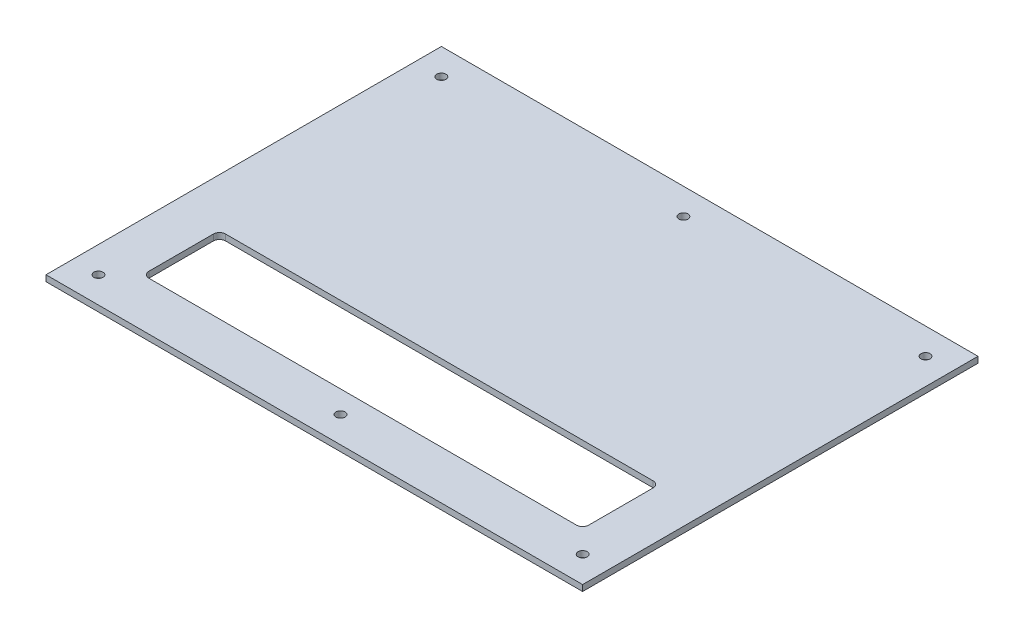
ISO-10303-21;
HEADER;
FILE_DESCRIPTION(('STEP AP214'),'2;1');
FILE_NAME('part.step','',(''),(''),'','','');
FILE_SCHEMA(('AUTOMOTIVE_DESIGN { 1 0 10303 214 1 1 1 1 }'));
ENDSEC;
DATA;
#1=APPLICATION_CONTEXT('core data for automotive mechanical design processes');
#2=APPLICATION_PROTOCOL_DEFINITION('international standard','automotive_design',2000,#1);
#3=PRODUCT_CONTEXT('',#1,'mechanical');
#4=PRODUCT('Part','Part','',(#3));
#5=PRODUCT_RELATED_PRODUCT_CATEGORY('part','',(#4));
#6=PRODUCT_DEFINITION_FORMATION('','',#4);
#7=PRODUCT_DEFINITION_CONTEXT('part definition',#1,'design');
#8=PRODUCT_DEFINITION('design','',#6,#7);
#9=PRODUCT_DEFINITION_SHAPE('','',#8);
#10=(LENGTH_UNIT() NAMED_UNIT(*) SI_UNIT(.MILLI.,.METRE.));
#11=(NAMED_UNIT(*) PLANE_ANGLE_UNIT() SI_UNIT($,.RADIAN.));
#12=(NAMED_UNIT(*) SI_UNIT($,.STERADIAN.) SOLID_ANGLE_UNIT());
#13=UNCERTAINTY_MEASURE_WITH_UNIT(LENGTH_MEASURE(1.E-05),#10,'distance_accuracy_value','');
#14=(GEOMETRIC_REPRESENTATION_CONTEXT(3) GLOBAL_UNCERTAINTY_ASSIGNED_CONTEXT((#13)) GLOBAL_UNIT_ASSIGNED_CONTEXT((#10,
#11,#12)) REPRESENTATION_CONTEXT('',''));
#15=CARTESIAN_POINT('',(0.,0.,0.));
#16=DIRECTION('',(0.,0.,1.));
#17=DIRECTION('',(1.,0.,0.));
#18=AXIS2_PLACEMENT_3D('',#15,#16,#17);
#19=CARTESIAN_POINT('',(0.,3.,0.));
#20=DIRECTION('',(0.,-1.,0.));
#21=DIRECTION('',(0.,0.,-1.));
#22=AXIS2_PLACEMENT_3D('',#19,#20,#21);
#23=PLANE('',#22);
#24=DIRECTION('',(0.,0.,1.));
#25=VECTOR('',#24,1.);
#26=CARTESIAN_POINT('',(241.999999999998,3.,-24.));
#27=LINE('',#26,#25);
#28=CARTESIAN_POINT('',(241.999999999998,3.,-59.));
#29=VERTEX_POINT('',#28);
#30=CARTESIAN_POINT('',(241.999999999998,3.,-27.));
#31=VERTEX_POINT('',#30);
#32=EDGE_CURVE('E208',#29,#31,#27,.T.);
#33=ORIENTED_EDGE('',*,*,#32,.T.);
#34=CARTESIAN_POINT('',(238.999999999998,3.,-27.));
#35=DIRECTION('',(0.,-1.,0.));
#36=DIRECTION('',(0.,0.,-1.));
#37=AXIS2_PLACEMENT_3D('',#34,#35,#36);
#38=CIRCLE('',#37,3.);
#39=CARTESIAN_POINT('',(238.999999999998,3.,-24.));
#40=VERTEX_POINT('',#39);
#41=EDGE_CURVE('E180',#31,#40,#38,.T.);
#42=ORIENTED_EDGE('',*,*,#41,.T.);
#43=DIRECTION('',(-1.,0.,0.));
#44=VECTOR('',#43,1.);
#45=CARTESIAN_POINT('',(23.9999999999977,3.,-24.));
#46=LINE('',#45,#44);
#47=CARTESIAN_POINT('',(26.9999999999977,3.,-24.));
#48=VERTEX_POINT('',#47);
#49=EDGE_CURVE('E213',#40,#48,#46,.T.);
#50=ORIENTED_EDGE('',*,*,#49,.T.);
#51=CARTESIAN_POINT('',(26.9999999999977,3.,-27.));
#52=DIRECTION('',(0.,-1.,0.));
#53=DIRECTION('',(0.,0.,-1.));
#54=AXIS2_PLACEMENT_3D('',#51,#52,#53);
#55=CIRCLE('',#54,3.);
#56=CARTESIAN_POINT('',(23.9999999999977,3.,-27.));
#57=VERTEX_POINT('',#56);
#58=EDGE_CURVE('E11',#48,#57,#55,.T.);
#59=ORIENTED_EDGE('',*,*,#58,.T.);
#60=DIRECTION('',(0.,0.,-1.));
#61=VECTOR('',#60,1.);
#62=CARTESIAN_POINT('',(23.9999999999977,3.,-24.));
#63=LINE('',#62,#61);
#64=CARTESIAN_POINT('',(23.9999999999977,3.,-59.));
#65=VERTEX_POINT('',#64);
#66=EDGE_CURVE('E200',#57,#65,#63,.T.);
#67=ORIENTED_EDGE('',*,*,#66,.T.);
#68=CARTESIAN_POINT('',(26.9999999999977,3.,-59.));
#69=DIRECTION('',(0.,-1.,0.));
#70=DIRECTION('',(0.,0.,-1.));
#71=AXIS2_PLACEMENT_3D('',#68,#69,#70);
#72=CIRCLE('',#71,3.);
#73=CARTESIAN_POINT('',(26.9999999999977,3.,-62.));
#74=VERTEX_POINT('',#73);
#75=EDGE_CURVE('E184',#65,#74,#72,.T.);
#76=ORIENTED_EDGE('',*,*,#75,.T.);
#77=DIRECTION('',(1.,0.,0.));
#78=VECTOR('',#77,1.);
#79=CARTESIAN_POINT('',(23.9999999999977,3.,-62.));
#80=LINE('',#79,#78);
#81=CARTESIAN_POINT('',(238.999999999998,3.,-62.));
#82=VERTEX_POINT('',#81);
#83=EDGE_CURVE('E205',#74,#82,#80,.T.);
#84=ORIENTED_EDGE('',*,*,#83,.T.);
#85=CARTESIAN_POINT('',(238.999999999998,3.,-59.));
#86=DIRECTION('',(0.,-1.,0.));
#87=DIRECTION('',(0.,0.,-1.));
#88=AXIS2_PLACEMENT_3D('',#85,#86,#87);
#89=CIRCLE('',#88,3.);
#90=EDGE_CURVE('E176',#82,#29,#89,.T.);
#91=ORIENTED_EDGE('',*,*,#90,.T.);
#92=EDGE_LOOP('',(#33,#42,#50,#59,#67,#76,#84,#91));
#93=FACE_BOUND('',#92,.T.);
#94=DIRECTION('',(0.,0.,1.));
#95=VECTOR('',#94,1.);
#96=CARTESIAN_POINT('',(0.,3.,0.));
#97=LINE('',#96,#95);
#98=CARTESIAN_POINT('',(0.,3.,-196.));
#99=VERTEX_POINT('',#98);
#100=CARTESIAN_POINT('',(0.,3.,0.));
#101=VERTEX_POINT('',#100);
#102=EDGE_CURVE('E136',#99,#101,#97,.T.);
#103=ORIENTED_EDGE('',*,*,#102,.T.);
#104=DIRECTION('',(1.,0.,0.));
#105=VECTOR('',#104,1.);
#106=CARTESIAN_POINT('',(0.,3.,0.));
#107=LINE('',#106,#105);
#108=CARTESIAN_POINT('',(266.,3.,0.));
#109=VERTEX_POINT('',#108);
#110=EDGE_CURVE('E125',#101,#109,#107,.T.);
#111=ORIENTED_EDGE('',*,*,#110,.T.);
#112=DIRECTION('',(0.,0.,-1.));
#113=VECTOR('',#112,1.);
#114=CARTESIAN_POINT('',(266.,3.,0.));
#115=LINE('',#114,#113);
#116=CARTESIAN_POINT('',(266.,3.,-196.));
#117=VERTEX_POINT('',#116);
#118=EDGE_CURVE('E135',#109,#117,#115,.T.);
#119=ORIENTED_EDGE('',*,*,#118,.T.);
#120=DIRECTION('',(-1.,0.,0.));
#121=VECTOR('',#120,1.);
#122=CARTESIAN_POINT('',(0.,3.,-196.));
#123=LINE('',#122,#121);
#124=EDGE_CURVE('E141',#117,#99,#123,.T.);
#125=ORIENTED_EDGE('',*,*,#124,.T.);
#126=EDGE_LOOP('',(#103,#111,#119,#125));
#127=FACE_BOUND('',#126,.T.);
#128=CARTESIAN_POINT('',(13.,3.,-183.));
#129=DIRECTION('',(0.,1.,0.));
#130=DIRECTION('',(0.,0.,1.));
#131=AXIS2_PLACEMENT_3D('',#128,#129,#130);
#132=CIRCLE('',#131,2.25);
#133=CARTESIAN_POINT('',(13.,3.,-180.75));
#134=VERTEX_POINT('',#133);
#135=EDGE_CURVE('E252',#134,#134,#132,.T.);
#136=ORIENTED_EDGE('',*,*,#135,.F.);
#137=EDGE_LOOP('',(#136));
#138=FACE_BOUND('',#137,.T.);
#139=CARTESIAN_POINT('',(253.,3.,-183.));
#140=DIRECTION('',(0.,1.,0.));
#141=DIRECTION('',(0.,0.,1.));
#142=AXIS2_PLACEMENT_3D('',#139,#140,#141);
#143=CIRCLE('',#142,2.24999999999996);
#144=CARTESIAN_POINT('',(253.,3.,-180.75));
#145=VERTEX_POINT('',#144);
#146=EDGE_CURVE('E246',#145,#145,#143,.T.);
#147=ORIENTED_EDGE('',*,*,#146,.F.);
#148=EDGE_LOOP('',(#147));
#149=FACE_BOUND('',#148,.T.);
#150=CARTESIAN_POINT('',(253.,3.,-13.));
#151=DIRECTION('',(0.,1.,0.));
#152=DIRECTION('',(0.,0.,1.));
#153=AXIS2_PLACEMENT_3D('',#150,#151,#152);
#154=CIRCLE('',#153,2.24999999999995);
#155=CARTESIAN_POINT('',(253.,3.,-10.7500000000001));
#156=VERTEX_POINT('',#155);
#157=EDGE_CURVE('E240',#156,#156,#154,.T.);
#158=ORIENTED_EDGE('',*,*,#157,.F.);
#159=EDGE_LOOP('',(#158));
#160=FACE_BOUND('',#159,.T.);
#161=CARTESIAN_POINT('',(13.,3.,-13.));
#162=DIRECTION('',(0.,1.,0.));
#163=DIRECTION('',(0.,0.,1.));
#164=AXIS2_PLACEMENT_3D('',#161,#162,#163);
#165=CIRCLE('',#164,2.25);
#166=CARTESIAN_POINT('',(13.,3.,-10.75));
#167=VERTEX_POINT('',#166);
#168=EDGE_CURVE('E234',#167,#167,#165,.T.);
#169=ORIENTED_EDGE('',*,*,#168,.F.);
#170=EDGE_LOOP('',(#169));
#171=FACE_BOUND('',#170,.T.);
#172=CARTESIAN_POINT('',(133.,3.,-13.));
#173=DIRECTION('',(0.,1.,0.));
#174=DIRECTION('',(0.,0.,1.));
#175=AXIS2_PLACEMENT_3D('',#172,#173,#174);
#176=CIRCLE('',#175,2.25000000000004);
#177=CARTESIAN_POINT('',(133.,3.,-10.75));
#178=VERTEX_POINT('',#177);
#179=EDGE_CURVE('E228',#178,#178,#176,.T.);
#180=ORIENTED_EDGE('',*,*,#179,.F.);
#181=EDGE_LOOP('',(#180));
#182=FACE_BOUND('',#181,.T.);
#183=CARTESIAN_POINT('',(133.,3.,-183.));
#184=DIRECTION('',(0.,1.,0.));
#185=DIRECTION('',(0.,0.,1.));
#186=AXIS2_PLACEMENT_3D('',#183,#184,#185);
#187=CIRCLE('',#186,2.25000000000001);
#188=CARTESIAN_POINT('',(133.,3.,-180.75));
#189=VERTEX_POINT('',#188);
#190=EDGE_CURVE('E222',#189,#189,#187,.T.);
#191=ORIENTED_EDGE('',*,*,#190,.F.);
#192=EDGE_LOOP('',(#191));
#193=FACE_BOUND('',#192,.T.);
#194=ADVANCED_FACE('F36',(#93,#127,#138,#149,#160,#171,#182,#193),#23,.F.);
#195=CARTESIAN_POINT('',(0.,0.,0.));
#196=DIRECTION('',(0.,-1.,0.));
#197=DIRECTION('',(0.,0.,-1.));
#198=AXIS2_PLACEMENT_3D('',#195,#196,#197);
#199=PLANE('',#198);
#200=DIRECTION('',(0.,0.,-1.));
#201=VECTOR('',#200,1.);
#202=CARTESIAN_POINT('',(23.9999999999977,0.,-24.));
#203=LINE('',#202,#201);
#204=CARTESIAN_POINT('',(23.9999999999977,0.,-27.));
#205=VERTEX_POINT('',#204);
#206=CARTESIAN_POINT('',(23.9999999999977,0.,-59.));
#207=VERTEX_POINT('',#206);
#208=EDGE_CURVE('E192',#205,#207,#203,.T.);
#209=ORIENTED_EDGE('',*,*,#208,.F.);
#210=CARTESIAN_POINT('',(26.9999999999977,0.,-27.));
#211=DIRECTION('',(0.,-1.,0.));
#212=DIRECTION('',(0.,0.,-1.));
#213=AXIS2_PLACEMENT_3D('',#210,#211,#212);
#214=CIRCLE('',#213,3.);
#215=CARTESIAN_POINT('',(26.9999999999977,0.,-24.));
#216=VERTEX_POINT('',#215);
#217=EDGE_CURVE('E44',#205,#216,#214,.F.);
#218=ORIENTED_EDGE('',*,*,#217,.T.);
#219=DIRECTION('',(-1.,0.,0.));
#220=VECTOR('',#219,1.);
#221=CARTESIAN_POINT('',(23.9999999999977,0.,-24.));
#222=LINE('',#221,#220);
#223=CARTESIAN_POINT('',(238.999999999998,0.,-24.));
#224=VERTEX_POINT('',#223);
#225=EDGE_CURVE('E191',#224,#216,#222,.T.);
#226=ORIENTED_EDGE('',*,*,#225,.F.);
#227=CARTESIAN_POINT('',(238.999999999998,0.,-27.));
#228=DIRECTION('',(0.,-1.,0.));
#229=DIRECTION('',(0.,0.,-1.));
#230=AXIS2_PLACEMENT_3D('',#227,#228,#229);
#231=CIRCLE('',#230,3.);
#232=CARTESIAN_POINT('',(241.999999999998,0.,-27.));
#233=VERTEX_POINT('',#232);
#234=EDGE_CURVE('E178',#224,#233,#231,.F.);
#235=ORIENTED_EDGE('',*,*,#234,.T.);
#236=DIRECTION('',(0.,0.,1.));
#237=VECTOR('',#236,1.);
#238=CARTESIAN_POINT('',(241.999999999998,0.,-24.));
#239=LINE('',#238,#237);
#240=CARTESIAN_POINT('',(241.999999999998,0.,-59.));
#241=VERTEX_POINT('',#240);
#242=EDGE_CURVE('E201',#241,#233,#239,.T.);
#243=ORIENTED_EDGE('',*,*,#242,.F.);
#244=CARTESIAN_POINT('',(238.999999999998,0.,-59.));
#245=DIRECTION('',(0.,-1.,0.));
#246=DIRECTION('',(0.,0.,-1.));
#247=AXIS2_PLACEMENT_3D('',#244,#245,#246);
#248=CIRCLE('',#247,3.);
#249=CARTESIAN_POINT('',(238.999999999998,0.,-62.));
#250=VERTEX_POINT('',#249);
#251=EDGE_CURVE('E174',#241,#250,#248,.F.);
#252=ORIENTED_EDGE('',*,*,#251,.T.);
#253=DIRECTION('',(1.,0.,0.));
#254=VECTOR('',#253,1.);
#255=CARTESIAN_POINT('',(23.9999999999977,0.,-62.));
#256=LINE('',#255,#254);
#257=CARTESIAN_POINT('',(26.9999999999977,0.,-62.));
#258=VERTEX_POINT('',#257);
#259=EDGE_CURVE('E217',#258,#250,#256,.T.);
#260=ORIENTED_EDGE('',*,*,#259,.F.);
#261=CARTESIAN_POINT('',(26.9999999999977,0.,-59.));
#262=DIRECTION('',(0.,-1.,0.));
#263=DIRECTION('',(0.,0.,-1.));
#264=AXIS2_PLACEMENT_3D('',#261,#262,#263);
#265=CIRCLE('',#264,3.);
#266=EDGE_CURVE('E182',#258,#207,#265,.F.);
#267=ORIENTED_EDGE('',*,*,#266,.T.);
#268=EDGE_LOOP('',(#209,#218,#226,#235,#243,#252,#260,#267));
#269=FACE_BOUND('',#268,.T.);
#270=CARTESIAN_POINT('',(133.,0.,-13.));
#271=DIRECTION('',(0.,1.,0.));
#272=DIRECTION('',(0.,0.,1.));
#273=AXIS2_PLACEMENT_3D('',#270,#271,#272);
#274=CIRCLE('',#273,2.25000000000004);
#275=CARTESIAN_POINT('',(133.,0.,-10.75));
#276=VERTEX_POINT('',#275);
#277=EDGE_CURVE('E225',#276,#276,#274,.T.);
#278=ORIENTED_EDGE('',*,*,#277,.T.);
#279=EDGE_LOOP('',(#278));
#280=FACE_BOUND('',#279,.T.);
#281=CARTESIAN_POINT('',(253.,0.,-13.));
#282=DIRECTION('',(0.,1.,0.));
#283=DIRECTION('',(0.,0.,1.));
#284=AXIS2_PLACEMENT_3D('',#281,#282,#283);
#285=CIRCLE('',#284,2.24999999999995);
#286=CARTESIAN_POINT('',(253.,0.,-10.7500000000001));
#287=VERTEX_POINT('',#286);
#288=EDGE_CURVE('E237',#287,#287,#285,.T.);
#289=ORIENTED_EDGE('',*,*,#288,.T.);
#290=EDGE_LOOP('',(#289));
#291=FACE_BOUND('',#290,.T.);
#292=CARTESIAN_POINT('',(13.,0.,-183.));
#293=DIRECTION('',(0.,1.,0.));
#294=DIRECTION('',(0.,0.,1.));
#295=AXIS2_PLACEMENT_3D('',#292,#293,#294);
#296=CIRCLE('',#295,2.25);
#297=CARTESIAN_POINT('',(13.,0.,-180.75));
#298=VERTEX_POINT('',#297);
#299=EDGE_CURVE('E249',#298,#298,#296,.T.);
#300=ORIENTED_EDGE('',*,*,#299,.T.);
#301=EDGE_LOOP('',(#300));
#302=FACE_BOUND('',#301,.T.);
#303=DIRECTION('',(0.,0.,1.));
#304=VECTOR('',#303,1.);
#305=CARTESIAN_POINT('',(0.,0.,0.));
#306=LINE('',#305,#304);
#307=CARTESIAN_POINT('',(0.,0.,-196.));
#308=VERTEX_POINT('',#307);
#309=CARTESIAN_POINT('',(0.,0.,0.));
#310=VERTEX_POINT('',#309);
#311=EDGE_CURVE('E149',#308,#310,#306,.T.);
#312=ORIENTED_EDGE('',*,*,#311,.F.);
#313=DIRECTION('',(-1.,0.,0.));
#314=VECTOR('',#313,1.);
#315=CARTESIAN_POINT('',(0.,0.,-196.));
#316=LINE('',#315,#314);
#317=CARTESIAN_POINT('',(266.,0.,-196.));
#318=VERTEX_POINT('',#317);
#319=EDGE_CURVE('E145',#318,#308,#316,.T.);
#320=ORIENTED_EDGE('',*,*,#319,.F.);
#321=DIRECTION('',(0.,0.,-1.));
#322=VECTOR('',#321,1.);
#323=CARTESIAN_POINT('',(266.,0.,0.));
#324=LINE('',#323,#322);
#325=CARTESIAN_POINT('',(266.,0.,0.));
#326=VERTEX_POINT('',#325);
#327=EDGE_CURVE('E263',#326,#318,#324,.T.);
#328=ORIENTED_EDGE('',*,*,#327,.F.);
#329=DIRECTION('',(1.,0.,0.));
#330=VECTOR('',#329,1.);
#331=CARTESIAN_POINT('',(0.,0.,0.));
#332=LINE('',#331,#330);
#333=EDGE_CURVE('E261',#310,#326,#332,.T.);
#334=ORIENTED_EDGE('',*,*,#333,.F.);
#335=EDGE_LOOP('',(#312,#320,#328,#334));
#336=FACE_BOUND('',#335,.T.);
#337=CARTESIAN_POINT('',(253.,0.,-183.));
#338=DIRECTION('',(0.,1.,0.));
#339=DIRECTION('',(0.,0.,1.));
#340=AXIS2_PLACEMENT_3D('',#337,#338,#339);
#341=CIRCLE('',#340,2.24999999999996);
#342=CARTESIAN_POINT('',(253.,0.,-180.75));
#343=VERTEX_POINT('',#342);
#344=EDGE_CURVE('E243',#343,#343,#341,.T.);
#345=ORIENTED_EDGE('',*,*,#344,.T.);
#346=EDGE_LOOP('',(#345));
#347=FACE_BOUND('',#346,.T.);
#348=CARTESIAN_POINT('',(13.,0.,-13.));
#349=DIRECTION('',(0.,1.,0.));
#350=DIRECTION('',(0.,0.,1.));
#351=AXIS2_PLACEMENT_3D('',#348,#349,#350);
#352=CIRCLE('',#351,2.25);
#353=CARTESIAN_POINT('',(13.,0.,-10.75));
#354=VERTEX_POINT('',#353);
#355=EDGE_CURVE('E231',#354,#354,#352,.T.);
#356=ORIENTED_EDGE('',*,*,#355,.T.);
#357=EDGE_LOOP('',(#356));
#358=FACE_BOUND('',#357,.T.);
#359=CARTESIAN_POINT('',(133.,0.,-183.));
#360=DIRECTION('',(0.,1.,0.));
#361=DIRECTION('',(0.,0.,1.));
#362=AXIS2_PLACEMENT_3D('',#359,#360,#361);
#363=CIRCLE('',#362,2.25000000000001);
#364=CARTESIAN_POINT('',(133.,0.,-180.75));
#365=VERTEX_POINT('',#364);
#366=EDGE_CURVE('E215',#365,#365,#363,.T.);
#367=ORIENTED_EDGE('',*,*,#366,.T.);
#368=EDGE_LOOP('',(#367));
#369=FACE_BOUND('',#368,.T.);
#370=ADVANCED_FACE('F189',(#269,#280,#291,#302,#336,#347,#358,#369),#199,.T.);
#371=CARTESIAN_POINT('',(0.,3.,0.));
#372=DIRECTION('',(1.,0.,0.));
#373=DIRECTION('',(0.,0.,-1.));
#374=AXIS2_PLACEMENT_3D('',#371,#372,#373);
#375=PLANE('',#374);
#376=ORIENTED_EDGE('',*,*,#311,.T.);
#377=DIRECTION('',(0.,-1.,0.));
#378=VECTOR('',#377,1.);
#379=CARTESIAN_POINT('',(0.,3.,0.));
#380=LINE('',#379,#378);
#381=EDGE_CURVE('E129',#101,#310,#380,.T.);
#382=ORIENTED_EDGE('',*,*,#381,.F.);
#383=ORIENTED_EDGE('',*,*,#102,.F.);
#384=DIRECTION('',(0.,-1.,0.));
#385=VECTOR('',#384,1.);
#386=CARTESIAN_POINT('',(0.,3.,-196.));
#387=LINE('',#386,#385);
#388=EDGE_CURVE('E259',#99,#308,#387,.T.);
#389=ORIENTED_EDGE('',*,*,#388,.T.);
#390=EDGE_LOOP('',(#376,#382,#383,#389));
#391=FACE_BOUND('',#390,.T.);
#392=ADVANCED_FACE('F147',(#391),#375,.F.);
#393=CARTESIAN_POINT('',(0.,3.,0.));
#394=DIRECTION('',(0.,0.,-1.));
#395=DIRECTION('',(-1.,0.,0.));
#396=AXIS2_PLACEMENT_3D('',#393,#394,#395);
#397=PLANE('',#396);
#398=ORIENTED_EDGE('',*,*,#333,.T.);
#399=DIRECTION('',(0.,-1.,0.));
#400=VECTOR('',#399,1.);
#401=CARTESIAN_POINT('',(266.,3.,0.));
#402=LINE('',#401,#400);
#403=EDGE_CURVE('E132',#109,#326,#402,.T.);
#404=ORIENTED_EDGE('',*,*,#403,.F.);
#405=ORIENTED_EDGE('',*,*,#110,.F.);
#406=ORIENTED_EDGE('',*,*,#381,.T.);
#407=EDGE_LOOP('',(#398,#404,#405,#406));
#408=FACE_BOUND('',#407,.T.);
#409=ADVANCED_FACE('F127',(#408),#397,.F.);
#410=CARTESIAN_POINT('',(266.,3.,0.));
#411=DIRECTION('',(-1.,0.,0.));
#412=DIRECTION('',(0.,0.,1.));
#413=AXIS2_PLACEMENT_3D('',#410,#411,#412);
#414=PLANE('',#413);
#415=ORIENTED_EDGE('',*,*,#327,.T.);
#416=DIRECTION('',(0.,-1.,0.));
#417=VECTOR('',#416,1.);
#418=CARTESIAN_POINT('',(266.,3.,-196.));
#419=LINE('',#418,#417);
#420=EDGE_CURVE('E154',#117,#318,#419,.T.);
#421=ORIENTED_EDGE('',*,*,#420,.F.);
#422=ORIENTED_EDGE('',*,*,#118,.F.);
#423=ORIENTED_EDGE('',*,*,#403,.T.);
#424=EDGE_LOOP('',(#415,#421,#422,#423));
#425=FACE_BOUND('',#424,.T.);
#426=ADVANCED_FACE('F275',(#425),#414,.F.);
#427=CARTESIAN_POINT('',(0.,3.,-196.));
#428=DIRECTION('',(0.,0.,1.));
#429=DIRECTION('',(1.,0.,0.));
#430=AXIS2_PLACEMENT_3D('',#427,#428,#429);
#431=PLANE('',#430);
#432=ORIENTED_EDGE('',*,*,#319,.T.);
#433=ORIENTED_EDGE('',*,*,#388,.F.);
#434=ORIENTED_EDGE('',*,*,#124,.F.);
#435=ORIENTED_EDGE('',*,*,#420,.T.);
#436=EDGE_LOOP('',(#432,#433,#434,#435));
#437=FACE_BOUND('',#436,.T.);
#438=ADVANCED_FACE('F270',(#437),#431,.F.);
#439=CARTESIAN_POINT('',(13.,3.,-183.));
#440=DIRECTION('',(0.,-1.,0.));
#441=DIRECTION('',(0.,0.,-1.));
#442=AXIS2_PLACEMENT_3D('',#439,#440,#441);
#443=CYLINDRICAL_SURFACE('',#442,2.25);
#444=ORIENTED_EDGE('',*,*,#135,.T.);
#445=EDGE_LOOP('',(#444));
#446=FACE_BOUND('',#445,.T.);
#447=ORIENTED_EDGE('',*,*,#299,.F.);
#448=EDGE_LOOP('',(#447));
#449=FACE_BOUND('',#448,.T.);
#450=ADVANCED_FACE('F282',(#446,#449),#443,.F.);
#451=CARTESIAN_POINT('',(253.,3.,-183.));
#452=DIRECTION('',(0.,-1.,0.));
#453=DIRECTION('',(0.,0.,-1.));
#454=AXIS2_PLACEMENT_3D('',#451,#452,#453);
#455=CYLINDRICAL_SURFACE('',#454,2.24999999999996);
#456=ORIENTED_EDGE('',*,*,#146,.T.);
#457=EDGE_LOOP('',(#456));
#458=FACE_BOUND('',#457,.T.);
#459=ORIENTED_EDGE('',*,*,#344,.F.);
#460=EDGE_LOOP('',(#459));
#461=FACE_BOUND('',#460,.T.);
#462=ADVANCED_FACE('F294',(#458,#461),#455,.F.);
#463=CARTESIAN_POINT('',(253.,3.,-13.));
#464=DIRECTION('',(0.,-1.,0.));
#465=DIRECTION('',(0.,0.,-1.));
#466=AXIS2_PLACEMENT_3D('',#463,#464,#465);
#467=CYLINDRICAL_SURFACE('',#466,2.24999999999995);
#468=ORIENTED_EDGE('',*,*,#157,.T.);
#469=EDGE_LOOP('',(#468));
#470=FACE_BOUND('',#469,.T.);
#471=ORIENTED_EDGE('',*,*,#288,.F.);
#472=EDGE_LOOP('',(#471));
#473=FACE_BOUND('',#472,.T.);
#474=ADVANCED_FACE('F298',(#470,#473),#467,.F.);
#475=CARTESIAN_POINT('',(13.,3.,-13.));
#476=DIRECTION('',(0.,-1.,0.));
#477=DIRECTION('',(0.,0.,-1.));
#478=AXIS2_PLACEMENT_3D('',#475,#476,#477);
#479=CYLINDRICAL_SURFACE('',#478,2.25);
#480=ORIENTED_EDGE('',*,*,#168,.T.);
#481=EDGE_LOOP('',(#480));
#482=FACE_BOUND('',#481,.T.);
#483=ORIENTED_EDGE('',*,*,#355,.F.);
#484=EDGE_LOOP('',(#483));
#485=FACE_BOUND('',#484,.T.);
#486=ADVANCED_FACE('F302',(#482,#485),#479,.F.);
#487=CARTESIAN_POINT('',(133.,3.,-13.));
#488=DIRECTION('',(0.,-1.,0.));
#489=DIRECTION('',(0.,0.,-1.));
#490=AXIS2_PLACEMENT_3D('',#487,#488,#489);
#491=CYLINDRICAL_SURFACE('',#490,2.25000000000004);
#492=ORIENTED_EDGE('',*,*,#179,.T.);
#493=EDGE_LOOP('',(#492));
#494=FACE_BOUND('',#493,.T.);
#495=ORIENTED_EDGE('',*,*,#277,.F.);
#496=EDGE_LOOP('',(#495));
#497=FACE_BOUND('',#496,.T.);
#498=ADVANCED_FACE('F306',(#494,#497),#491,.F.);
#499=CARTESIAN_POINT('',(133.,3.,-183.));
#500=DIRECTION('',(0.,-1.,0.));
#501=DIRECTION('',(0.,0.,-1.));
#502=AXIS2_PLACEMENT_3D('',#499,#500,#501);
#503=CYLINDRICAL_SURFACE('',#502,2.25000000000001);
#504=ORIENTED_EDGE('',*,*,#190,.T.);
#505=EDGE_LOOP('',(#504));
#506=FACE_BOUND('',#505,.T.);
#507=ORIENTED_EDGE('',*,*,#366,.F.);
#508=EDGE_LOOP('',(#507));
#509=FACE_BOUND('',#508,.T.);
#510=ADVANCED_FACE('F310',(#506,#509),#503,.F.);
#511=CARTESIAN_POINT('',(23.9999999999977,3.,-24.));
#512=DIRECTION('',(-1.,0.,0.));
#513=DIRECTION('',(0.,0.,1.));
#514=AXIS2_PLACEMENT_3D('',#511,#512,#513);
#515=PLANE('',#514);
#516=ORIENTED_EDGE('',*,*,#208,.T.);
#517=DIRECTION('',(0.,-1.,0.));
#518=VECTOR('',#517,1.);
#519=CARTESIAN_POINT('',(23.9999999999977,3.,-59.));
#520=LINE('',#519,#518);
#521=EDGE_CURVE('E51',#207,#65,#520,.F.);
#522=ORIENTED_EDGE('',*,*,#521,.T.);
#523=ORIENTED_EDGE('',*,*,#66,.F.);
#524=DIRECTION('',(0.,-1.,0.));
#525=VECTOR('',#524,1.);
#526=CARTESIAN_POINT('',(23.9999999999977,0.,-27.));
#527=LINE('',#526,#525);
#528=EDGE_CURVE('E170',#57,#205,#527,.T.);
#529=ORIENTED_EDGE('',*,*,#528,.T.);
#530=EDGE_LOOP('',(#516,#522,#523,#529));
#531=FACE_BOUND('',#530,.T.);
#532=ADVANCED_FACE('F203',(#531),#515,.F.);
#533=CARTESIAN_POINT('',(23.9999999999977,3.,-24.));
#534=DIRECTION('',(0.,0.,1.));
#535=DIRECTION('',(1.,0.,0.));
#536=AXIS2_PLACEMENT_3D('',#533,#534,#535);
#537=PLANE('',#536);
#538=ORIENTED_EDGE('',*,*,#49,.F.);
#539=DIRECTION('',(0.,-1.,0.));
#540=VECTOR('',#539,1.);
#541=CARTESIAN_POINT('',(238.999999999998,0.,-24.));
#542=LINE('',#541,#540);
#543=EDGE_CURVE('E167',#40,#224,#542,.T.);
#544=ORIENTED_EDGE('',*,*,#543,.T.);
#545=ORIENTED_EDGE('',*,*,#225,.T.);
#546=DIRECTION('',(0.,-1.,0.));
#547=VECTOR('',#546,1.);
#548=CARTESIAN_POINT('',(26.9999999999977,3.,-24.));
#549=LINE('',#548,#547);
#550=EDGE_CURVE('E165',#216,#48,#549,.F.);
#551=ORIENTED_EDGE('',*,*,#550,.T.);
#552=EDGE_LOOP('',(#538,#544,#545,#551));
#553=FACE_BOUND('',#552,.T.);
#554=ADVANCED_FACE('F198',(#553),#537,.F.);
#555=CARTESIAN_POINT('',(241.999999999998,3.,-24.));
#556=DIRECTION('',(1.,0.,0.));
#557=DIRECTION('',(0.,0.,-1.));
#558=AXIS2_PLACEMENT_3D('',#555,#556,#557);
#559=PLANE('',#558);
#560=ORIENTED_EDGE('',*,*,#32,.F.);
#561=DIRECTION('',(0.,-1.,0.));
#562=VECTOR('',#561,1.);
#563=CARTESIAN_POINT('',(241.999999999998,0.,-59.));
#564=LINE('',#563,#562);
#565=EDGE_CURVE('E152',#29,#241,#564,.T.);
#566=ORIENTED_EDGE('',*,*,#565,.T.);
#567=ORIENTED_EDGE('',*,*,#242,.T.);
#568=DIRECTION('',(0.,-1.,0.));
#569=VECTOR('',#568,1.);
#570=CARTESIAN_POINT('',(241.999999999998,3.,-27.));
#571=LINE('',#570,#569);
#572=EDGE_CURVE('E150',#233,#31,#571,.F.);
#573=ORIENTED_EDGE('',*,*,#572,.T.);
#574=EDGE_LOOP('',(#560,#566,#567,#573));
#575=FACE_BOUND('',#574,.T.);
#576=ADVANCED_FACE('F321',(#575),#559,.F.);
#577=CARTESIAN_POINT('',(23.9999999999977,3.,-62.));
#578=DIRECTION('',(0.,0.,-1.));
#579=DIRECTION('',(-1.,0.,0.));
#580=AXIS2_PLACEMENT_3D('',#577,#578,#579);
#581=PLANE('',#580);
#582=ORIENTED_EDGE('',*,*,#259,.T.);
#583=DIRECTION('',(0.,-1.,0.));
#584=VECTOR('',#583,1.);
#585=CARTESIAN_POINT('',(238.999999999998,3.,-62.));
#586=LINE('',#585,#584);
#587=EDGE_CURVE('E163',#250,#82,#586,.F.);
#588=ORIENTED_EDGE('',*,*,#587,.T.);
#589=ORIENTED_EDGE('',*,*,#83,.F.);
#590=DIRECTION('',(0.,-1.,0.));
#591=VECTOR('',#590,1.);
#592=CARTESIAN_POINT('',(26.9999999999977,0.,-62.));
#593=LINE('',#592,#591);
#594=EDGE_CURVE('E160',#74,#258,#593,.T.);
#595=ORIENTED_EDGE('',*,*,#594,.T.);
#596=EDGE_LOOP('',(#582,#588,#589,#595));
#597=FACE_BOUND('',#596,.T.);
#598=ADVANCED_FACE('F317',(#597),#581,.F.);
#599=CARTESIAN_POINT('',(238.999999999998,3.,-59.));
#600=DIRECTION('',(0.,1.,0.));
#601=DIRECTION('',(0.,0.,1.));
#602=AXIS2_PLACEMENT_3D('',#599,#600,#601);
#603=CYLINDRICAL_SURFACE('',#602,3.);
#604=ORIENTED_EDGE('',*,*,#90,.F.);
#605=ORIENTED_EDGE('',*,*,#587,.F.);
#606=ORIENTED_EDGE('',*,*,#251,.F.);
#607=ORIENTED_EDGE('',*,*,#565,.F.);
#608=EDGE_LOOP('',(#604,#605,#606,#607));
#609=FACE_BOUND('',#608,.T.);
#610=ADVANCED_FACE('F320',(#609),#603,.F.);
#611=CARTESIAN_POINT('',(238.999999999998,3.,-27.));
#612=DIRECTION('',(0.,1.,0.));
#613=DIRECTION('',(0.,0.,1.));
#614=AXIS2_PLACEMENT_3D('',#611,#612,#613);
#615=CYLINDRICAL_SURFACE('',#614,3.);
#616=ORIENTED_EDGE('',*,*,#41,.F.);
#617=ORIENTED_EDGE('',*,*,#572,.F.);
#618=ORIENTED_EDGE('',*,*,#234,.F.);
#619=ORIENTED_EDGE('',*,*,#543,.F.);
#620=EDGE_LOOP('',(#616,#617,#618,#619));
#621=FACE_BOUND('',#620,.T.);
#622=ADVANCED_FACE('F345',(#621),#615,.F.);
#623=CARTESIAN_POINT('',(26.9999999999977,3.,-59.));
#624=DIRECTION('',(0.,1.,0.));
#625=DIRECTION('',(0.,0.,1.));
#626=AXIS2_PLACEMENT_3D('',#623,#624,#625);
#627=CYLINDRICAL_SURFACE('',#626,3.);
#628=ORIENTED_EDGE('',*,*,#75,.F.);
#629=ORIENTED_EDGE('',*,*,#521,.F.);
#630=ORIENTED_EDGE('',*,*,#266,.F.);
#631=ORIENTED_EDGE('',*,*,#594,.F.);
#632=EDGE_LOOP('',(#628,#629,#630,#631));
#633=FACE_BOUND('',#632,.T.);
#634=ADVANCED_FACE('F353',(#633),#627,.F.);
#635=CARTESIAN_POINT('',(26.9999999999977,3.,-27.));
#636=DIRECTION('',(0.,1.,0.));
#637=DIRECTION('',(0.,0.,1.));
#638=AXIS2_PLACEMENT_3D('',#635,#636,#637);
#639=CYLINDRICAL_SURFACE('',#638,3.);
#640=ORIENTED_EDGE('',*,*,#58,.F.);
#641=ORIENTED_EDGE('',*,*,#550,.F.);
#642=ORIENTED_EDGE('',*,*,#217,.F.);
#643=ORIENTED_EDGE('',*,*,#528,.F.);
#644=EDGE_LOOP('',(#640,#641,#642,#643));
#645=FACE_BOUND('',#644,.T.);
#646=ADVANCED_FACE('F38',(#645),#639,.F.);
#647=CLOSED_SHELL('',(#194,#370,#392,#409,#426,#438,#450,#462,#474,#486,#498,#510,#532,#554,
#576,#598,#610,#622,#634,#646));
#648=MANIFOLD_SOLID_BREP('B2',#647);
#649=ADVANCED_BREP_SHAPE_REPRESENTATION('',(#18,#648),#14);
#650=SHAPE_DEFINITION_REPRESENTATION(#9,#649);
ENDSEC;
END-ISO-10303-21;
